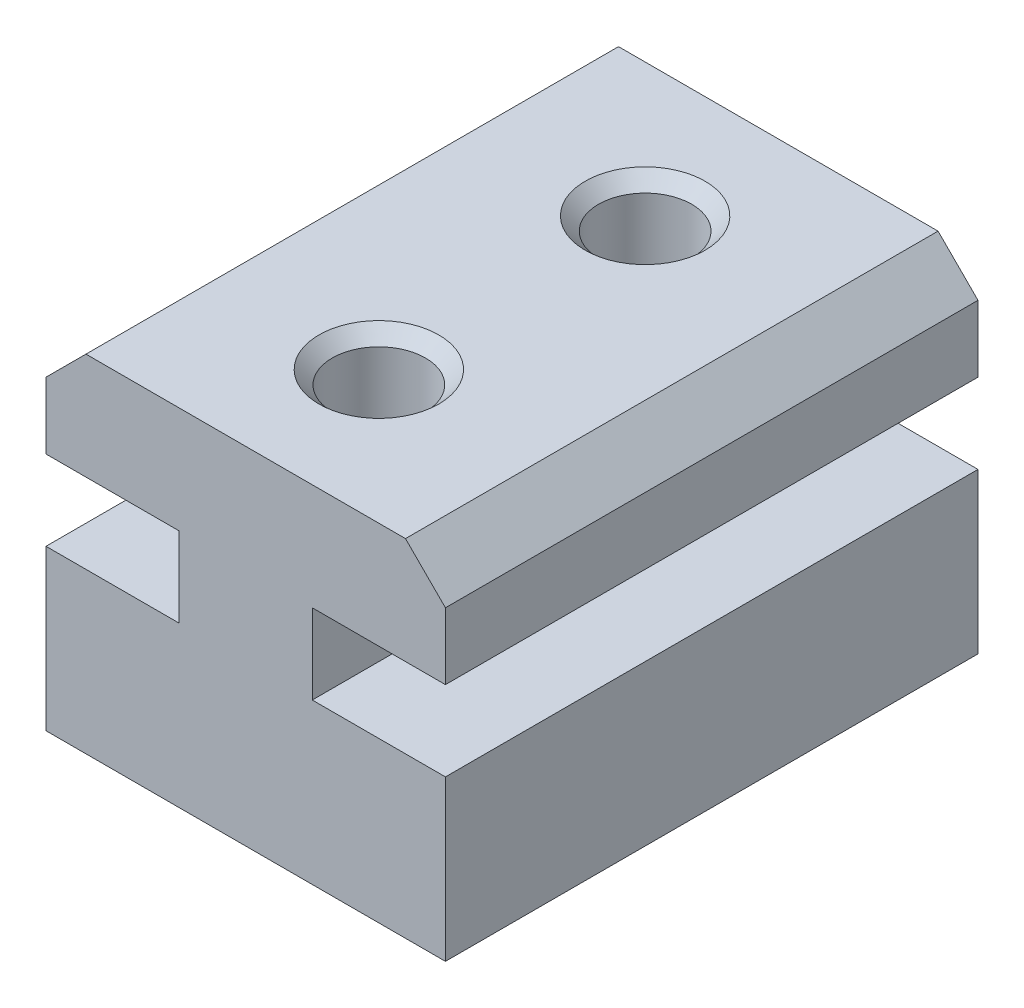
ISO-10303-21;
HEADER;
FILE_DESCRIPTION(('STEP AP214'),'2;1');
FILE_NAME('part.step','',(''),(''),'','','');
FILE_SCHEMA(('AUTOMOTIVE_DESIGN { 1 0 10303 214 1 1 1 1 }'));
ENDSEC;
DATA;
#1=APPLICATION_CONTEXT('core data for automotive mechanical design processes');
#2=APPLICATION_PROTOCOL_DEFINITION('international standard','automotive_design',2000,#1);
#3=PRODUCT_CONTEXT('',#1,'mechanical');
#4=PRODUCT('Part','Part','',(#3));
#5=PRODUCT_RELATED_PRODUCT_CATEGORY('part','',(#4));
#6=PRODUCT_DEFINITION_FORMATION('','',#4);
#7=PRODUCT_DEFINITION_CONTEXT('part definition',#1,'design');
#8=PRODUCT_DEFINITION('design','',#6,#7);
#9=PRODUCT_DEFINITION_SHAPE('','',#8);
#10=(LENGTH_UNIT() NAMED_UNIT(*) SI_UNIT(.MILLI.,.METRE.));
#11=(NAMED_UNIT(*) PLANE_ANGLE_UNIT() SI_UNIT($,.RADIAN.));
#12=(NAMED_UNIT(*) SI_UNIT($,.STERADIAN.) SOLID_ANGLE_UNIT());
#13=UNCERTAINTY_MEASURE_WITH_UNIT(LENGTH_MEASURE(1.E-05),#10,'distance_accuracy_value','');
#14=(GEOMETRIC_REPRESENTATION_CONTEXT(3) GLOBAL_UNCERTAINTY_ASSIGNED_CONTEXT((#13)) GLOBAL_UNIT_ASSIGNED_CONTEXT((#10,
#11,#12)) REPRESENTATION_CONTEXT('',''));
#15=CARTESIAN_POINT('',(0.,0.,0.));
#16=DIRECTION('',(0.,0.,1.));
#17=DIRECTION('',(1.,0.,0.));
#18=AXIS2_PLACEMENT_3D('',#15,#16,#17);
#19=CARTESIAN_POINT('',(0.,6.,10.));
#20=DIRECTION('',(1.,0.,0.));
#21=DIRECTION('',(0.,0.,-1.));
#22=AXIS2_PLACEMENT_3D('',#19,#20,#21);
#23=PLANE('',#22);
#24=DIRECTION('',(0.,-1.,0.));
#25=VECTOR('',#24,1.);
#26=CARTESIAN_POINT('',(0.,6.,-10.));
#27=LINE('',#26,#25);
#28=CARTESIAN_POINT('',(0.,6.,-10.));
#29=VERTEX_POINT('',#28);
#30=CARTESIAN_POINT('',(0.,0.,-10.));
#31=VERTEX_POINT('',#30);
#32=EDGE_CURVE('E177',#29,#31,#27,.T.);
#33=ORIENTED_EDGE('',*,*,#32,.T.);
#34=DIRECTION('',(0.,0.,-1.));
#35=VECTOR('',#34,1.);
#36=CARTESIAN_POINT('',(0.,0.,10.));
#37=LINE('',#36,#35);
#38=CARTESIAN_POINT('',(0.,0.,10.));
#39=VERTEX_POINT('',#38);
#40=EDGE_CURVE('E156',#39,#31,#37,.T.);
#41=ORIENTED_EDGE('',*,*,#40,.F.);
#42=DIRECTION('',(0.,-1.,0.));
#43=VECTOR('',#42,1.);
#44=CARTESIAN_POINT('',(0.,6.,10.));
#45=LINE('',#44,#43);
#46=CARTESIAN_POINT('',(0.,6.,10.));
#47=VERTEX_POINT('',#46);
#48=EDGE_CURVE('E164',#47,#39,#45,.T.);
#49=ORIENTED_EDGE('',*,*,#48,.F.);
#50=DIRECTION('',(0.,0.,-1.));
#51=VECTOR('',#50,1.);
#52=CARTESIAN_POINT('',(0.,6.,10.));
#53=LINE('',#52,#51);
#54=EDGE_CURVE('E274',#47,#29,#53,.T.);
#55=ORIENTED_EDGE('',*,*,#54,.T.);
#56=EDGE_LOOP('',(#33,#41,#49,#55));
#57=FACE_BOUND('',#56,.T.);
#58=ADVANCED_FACE('F45',(#57),#23,.F.);
#59=CARTESIAN_POINT('',(0.,0.,10.));
#60=DIRECTION('',(0.,1.,0.));
#61=DIRECTION('',(0.,0.,1.));
#62=AXIS2_PLACEMENT_3D('',#59,#60,#61);
#63=PLANE('',#62);
#64=CARTESIAN_POINT('',(7.5,0.,5.));
#65=DIRECTION('',(0.,1.,0.));
#66=DIRECTION('',(-1.,0.,0.));
#67=AXIS2_PLACEMENT_3D('',#64,#65,#66);
#68=CIRCLE('',#67,1.75);
#69=CARTESIAN_POINT('',(5.75,0.,5.));
#70=VERTEX_POINT('',#69);
#71=EDGE_CURVE('E240',#70,#70,#68,.T.);
#72=ORIENTED_EDGE('',*,*,#71,.T.);
#73=EDGE_LOOP('',(#72));
#74=FACE_BOUND('',#73,.T.);
#75=CARTESIAN_POINT('',(7.5,0.,-5.));
#76=DIRECTION('',(0.,1.,0.));
#77=DIRECTION('',(-1.,0.,0.));
#78=AXIS2_PLACEMENT_3D('',#75,#76,#77);
#79=CIRCLE('',#78,1.75);
#80=CARTESIAN_POINT('',(5.75,0.,-5.));
#81=VERTEX_POINT('',#80);
#82=EDGE_CURVE('E237',#81,#81,#79,.T.);
#83=ORIENTED_EDGE('',*,*,#82,.T.);
#84=EDGE_LOOP('',(#83));
#85=FACE_BOUND('',#84,.T.);
#86=DIRECTION('',(1.,0.,0.));
#87=VECTOR('',#86,1.);
#88=CARTESIAN_POINT('',(0.,0.,-10.));
#89=LINE('',#88,#87);
#90=CARTESIAN_POINT('',(15.,0.,-10.));
#91=VERTEX_POINT('',#90);
#92=EDGE_CURVE('E277',#31,#91,#89,.T.);
#93=ORIENTED_EDGE('',*,*,#92,.T.);
#94=DIRECTION('',(0.,0.,-1.));
#95=VECTOR('',#94,1.);
#96=CARTESIAN_POINT('',(15.,0.,10.));
#97=LINE('',#96,#95);
#98=CARTESIAN_POINT('',(15.,0.,10.));
#99=VERTEX_POINT('',#98);
#100=EDGE_CURVE('E159',#99,#91,#97,.T.);
#101=ORIENTED_EDGE('',*,*,#100,.F.);
#102=DIRECTION('',(1.,0.,0.));
#103=VECTOR('',#102,1.);
#104=CARTESIAN_POINT('',(0.,0.,10.));
#105=LINE('',#104,#103);
#106=EDGE_CURVE('E152',#39,#99,#105,.T.);
#107=ORIENTED_EDGE('',*,*,#106,.F.);
#108=ORIENTED_EDGE('',*,*,#40,.T.);
#109=EDGE_LOOP('',(#93,#101,#107,#108));
#110=FACE_BOUND('',#109,.T.);
#111=ADVANCED_FACE('F154',(#74,#85,#110),#63,.F.);
#112=CARTESIAN_POINT('',(15.,0.,10.));
#113=DIRECTION('',(-1.,0.,0.));
#114=DIRECTION('',(0.,0.,1.));
#115=AXIS2_PLACEMENT_3D('',#112,#113,#114);
#116=PLANE('',#115);
#117=DIRECTION('',(0.,1.,0.));
#118=VECTOR('',#117,1.);
#119=CARTESIAN_POINT('',(15.,0.,-10.));
#120=LINE('',#119,#118);
#121=CARTESIAN_POINT('',(15.,6.,-10.));
#122=VERTEX_POINT('',#121);
#123=EDGE_CURVE('E280',#91,#122,#120,.T.);
#124=ORIENTED_EDGE('',*,*,#123,.T.);
#125=DIRECTION('',(0.,0.,-1.));
#126=VECTOR('',#125,1.);
#127=CARTESIAN_POINT('',(15.,6.,10.));
#128=LINE('',#127,#126);
#129=CARTESIAN_POINT('',(15.,6.,10.));
#130=VERTEX_POINT('',#129);
#131=EDGE_CURVE('E186',#130,#122,#128,.T.);
#132=ORIENTED_EDGE('',*,*,#131,.F.);
#133=DIRECTION('',(0.,1.,0.));
#134=VECTOR('',#133,1.);
#135=CARTESIAN_POINT('',(15.,0.,10.));
#136=LINE('',#135,#134);
#137=EDGE_CURVE('E163',#99,#130,#136,.T.);
#138=ORIENTED_EDGE('',*,*,#137,.F.);
#139=ORIENTED_EDGE('',*,*,#100,.T.);
#140=EDGE_LOOP('',(#124,#132,#138,#139));
#141=FACE_BOUND('',#140,.T.);
#142=ADVANCED_FACE('F358',(#141),#116,.F.);
#143=CARTESIAN_POINT('',(15.,6.,10.));
#144=DIRECTION('',(0.,-1.,0.));
#145=DIRECTION('',(1.,0.,0.));
#146=AXIS2_PLACEMENT_3D('',#143,#144,#145);
#147=PLANE('',#146);
#148=DIRECTION('',(-1.,0.,0.));
#149=VECTOR('',#148,1.);
#150=CARTESIAN_POINT('',(15.,6.,-10.));
#151=LINE('',#150,#149);
#152=CARTESIAN_POINT('',(10.,6.,-10.));
#153=VERTEX_POINT('',#152);
#154=EDGE_CURVE('E283',#122,#153,#151,.T.);
#155=ORIENTED_EDGE('',*,*,#154,.T.);
#156=DIRECTION('',(0.,0.,-1.));
#157=VECTOR('',#156,1.);
#158=CARTESIAN_POINT('',(10.,6.,10.));
#159=LINE('',#158,#157);
#160=CARTESIAN_POINT('',(10.,6.,10.));
#161=VERTEX_POINT('',#160);
#162=EDGE_CURVE('E331',#161,#153,#159,.T.);
#163=ORIENTED_EDGE('',*,*,#162,.F.);
#164=DIRECTION('',(-1.,0.,0.));
#165=VECTOR('',#164,1.);
#166=CARTESIAN_POINT('',(15.,6.,10.));
#167=LINE('',#166,#165);
#168=EDGE_CURVE('E248',#130,#161,#167,.T.);
#169=ORIENTED_EDGE('',*,*,#168,.F.);
#170=ORIENTED_EDGE('',*,*,#131,.T.);
#171=EDGE_LOOP('',(#155,#163,#169,#170));
#172=FACE_BOUND('',#171,.T.);
#173=ADVANCED_FACE('F340',(#172),#147,.F.);
#174=CARTESIAN_POINT('',(10.,6.,10.));
#175=DIRECTION('',(-1.,0.,0.));
#176=DIRECTION('',(0.,0.,1.));
#177=AXIS2_PLACEMENT_3D('',#174,#175,#176);
#178=PLANE('',#177);
#179=DIRECTION('',(0.,1.,0.));
#180=VECTOR('',#179,1.);
#181=CARTESIAN_POINT('',(10.,6.,-10.));
#182=LINE('',#181,#180);
#183=CARTESIAN_POINT('',(10.,9.,-10.));
#184=VERTEX_POINT('',#183);
#185=EDGE_CURVE('E286',#153,#184,#182,.T.);
#186=ORIENTED_EDGE('',*,*,#185,.T.);
#187=DIRECTION('',(0.,0.,-1.));
#188=VECTOR('',#187,1.);
#189=CARTESIAN_POINT('',(10.,9.,10.));
#190=LINE('',#189,#188);
#191=CARTESIAN_POINT('',(10.,9.,10.));
#192=VERTEX_POINT('',#191);
#193=EDGE_CURVE('E327',#192,#184,#190,.T.);
#194=ORIENTED_EDGE('',*,*,#193,.F.);
#195=DIRECTION('',(0.,1.,0.));
#196=VECTOR('',#195,1.);
#197=CARTESIAN_POINT('',(10.,6.,10.));
#198=LINE('',#197,#196);
#199=EDGE_CURVE('E251',#161,#192,#198,.T.);
#200=ORIENTED_EDGE('',*,*,#199,.F.);
#201=ORIENTED_EDGE('',*,*,#162,.T.);
#202=EDGE_LOOP('',(#186,#194,#200,#201));
#203=FACE_BOUND('',#202,.T.);
#204=ADVANCED_FACE('F351',(#203),#178,.F.);
#205=CARTESIAN_POINT('',(10.,9.,10.));
#206=DIRECTION('',(0.,1.,0.));
#207=DIRECTION('',(0.,0.,1.));
#208=AXIS2_PLACEMENT_3D('',#205,#206,#207);
#209=PLANE('',#208);
#210=DIRECTION('',(1.,0.,0.));
#211=VECTOR('',#210,1.);
#212=CARTESIAN_POINT('',(10.,9.,-10.));
#213=LINE('',#212,#211);
#214=CARTESIAN_POINT('',(15.,9.,-10.));
#215=VERTEX_POINT('',#214);
#216=EDGE_CURVE('E289',#184,#215,#213,.T.);
#217=ORIENTED_EDGE('',*,*,#216,.T.);
#218=DIRECTION('',(0.,0.,-1.));
#219=VECTOR('',#218,1.);
#220=CARTESIAN_POINT('',(15.,9.,10.));
#221=LINE('',#220,#219);
#222=CARTESIAN_POINT('',(15.,9.,10.));
#223=VERTEX_POINT('',#222);
#224=EDGE_CURVE('E323',#223,#215,#221,.T.);
#225=ORIENTED_EDGE('',*,*,#224,.F.);
#226=DIRECTION('',(1.,0.,0.));
#227=VECTOR('',#226,1.);
#228=CARTESIAN_POINT('',(10.,9.,10.));
#229=LINE('',#228,#227);
#230=EDGE_CURVE('E254',#192,#223,#229,.T.);
#231=ORIENTED_EDGE('',*,*,#230,.F.);
#232=ORIENTED_EDGE('',*,*,#193,.T.);
#233=EDGE_LOOP('',(#217,#225,#231,#232));
#234=FACE_BOUND('',#233,.T.);
#235=ADVANCED_FACE('F355',(#234),#209,.F.);
#236=CARTESIAN_POINT('',(15.,9.,10.));
#237=DIRECTION('',(-1.,0.,0.));
#238=DIRECTION('',(0.,0.,1.));
#239=AXIS2_PLACEMENT_3D('',#236,#237,#238);
#240=PLANE('',#239);
#241=DIRECTION('',(0.,1.,0.));
#242=VECTOR('',#241,1.);
#243=CARTESIAN_POINT('',(15.,9.,-10.));
#244=LINE('',#243,#242);
#245=CARTESIAN_POINT('',(15.,11.5,-10.));
#246=VERTEX_POINT('',#245);
#247=EDGE_CURVE('E292',#215,#246,#244,.T.);
#248=ORIENTED_EDGE('',*,*,#247,.T.);
#249=DIRECTION('',(0.,0.,1.));
#250=VECTOR('',#249,1.);
#251=CARTESIAN_POINT('',(15.,11.5,10.));
#252=LINE('',#251,#250);
#253=CARTESIAN_POINT('',(15.,11.5,10.));
#254=VERTEX_POINT('',#253);
#255=EDGE_CURVE('E62',#246,#254,#252,.T.);
#256=ORIENTED_EDGE('',*,*,#255,.T.);
#257=DIRECTION('',(0.,1.,0.));
#258=VECTOR('',#257,1.);
#259=CARTESIAN_POINT('',(15.,9.,10.));
#260=LINE('',#259,#258);
#261=EDGE_CURVE('E257',#223,#254,#260,.T.);
#262=ORIENTED_EDGE('',*,*,#261,.F.);
#263=ORIENTED_EDGE('',*,*,#224,.T.);
#264=EDGE_LOOP('',(#248,#256,#262,#263));
#265=FACE_BOUND('',#264,.T.);
#266=ADVANCED_FACE('F429',(#265),#240,.F.);
#267=CARTESIAN_POINT('',(15.,13.,10.));
#268=DIRECTION('',(0.,-1.,0.));
#269=DIRECTION('',(1.,0.,0.));
#270=AXIS2_PLACEMENT_3D('',#267,#268,#269);
#271=PLANE('',#270);
#272=CARTESIAN_POINT('',(7.5,13.,-5.));
#273=DIRECTION('',(0.,-1.,0.));
#274=DIRECTION('',(1.,0.,0.));
#275=AXIS2_PLACEMENT_3D('',#272,#273,#274);
#276=CIRCLE('',#275,2.25);
#277=CARTESIAN_POINT('',(9.75000000000001,13.,-5.));
#278=VERTEX_POINT('',#277);
#279=EDGE_CURVE('E55',#278,#278,#276,.T.);
#280=ORIENTED_EDGE('',*,*,#279,.T.);
#281=EDGE_LOOP('',(#280));
#282=FACE_BOUND('',#281,.T.);
#283=CARTESIAN_POINT('',(7.5,13.,5.));
#284=DIRECTION('',(0.,-1.,0.));
#285=DIRECTION('',(1.,0.,0.));
#286=AXIS2_PLACEMENT_3D('',#283,#284,#285);
#287=CIRCLE('',#286,2.25);
#288=CARTESIAN_POINT('',(9.75000000000001,13.,5.));
#289=VERTEX_POINT('',#288);
#290=EDGE_CURVE('E213',#289,#289,#287,.T.);
#291=ORIENTED_EDGE('',*,*,#290,.T.);
#292=EDGE_LOOP('',(#291));
#293=FACE_BOUND('',#292,.T.);
#294=DIRECTION('',(-1.,0.,0.));
#295=VECTOR('',#294,1.);
#296=CARTESIAN_POINT('',(15.,13.,-10.));
#297=LINE('',#296,#295);
#298=CARTESIAN_POINT('',(13.5,13.,-10.));
#299=VERTEX_POINT('',#298);
#300=CARTESIAN_POINT('',(1.50000000000001,13.,-10.));
#301=VERTEX_POINT('',#300);
#302=EDGE_CURVE('E295',#299,#301,#297,.T.);
#303=ORIENTED_EDGE('',*,*,#302,.T.);
#304=DIRECTION('',(0.,0.,1.));
#305=VECTOR('',#304,1.);
#306=CARTESIAN_POINT('',(1.50000000000001,13.,10.));
#307=LINE('',#306,#305);
#308=CARTESIAN_POINT('',(1.50000000000001,13.,10.));
#309=VERTEX_POINT('',#308);
#310=EDGE_CURVE('E70',#301,#309,#307,.T.);
#311=ORIENTED_EDGE('',*,*,#310,.T.);
#312=DIRECTION('',(-1.,0.,0.));
#313=VECTOR('',#312,1.);
#314=CARTESIAN_POINT('',(15.,13.,10.));
#315=LINE('',#314,#313);
#316=CARTESIAN_POINT('',(13.5,13.,10.));
#317=VERTEX_POINT('',#316);
#318=EDGE_CURVE('E260',#317,#309,#315,.T.);
#319=ORIENTED_EDGE('',*,*,#318,.F.);
#320=DIRECTION('',(0.,0.,-1.));
#321=VECTOR('',#320,1.);
#322=CARTESIAN_POINT('',(13.5,13.,10.));
#323=LINE('',#322,#321);
#324=EDGE_CURVE('E195',#317,#299,#323,.T.);
#325=ORIENTED_EDGE('',*,*,#324,.T.);
#326=EDGE_LOOP('',(#303,#311,#319,#325));
#327=FACE_BOUND('',#326,.T.);
#328=ADVANCED_FACE('F220',(#282,#293,#327),#271,.F.);
#329=CARTESIAN_POINT('',(0.,13.,10.));
#330=DIRECTION('',(1.,0.,0.));
#331=DIRECTION('',(0.,1.,0.));
#332=AXIS2_PLACEMENT_3D('',#329,#330,#331);
#333=PLANE('',#332);
#334=DIRECTION('',(0.,-1.,0.));
#335=VECTOR('',#334,1.);
#336=CARTESIAN_POINT('',(0.,13.,10.));
#337=LINE('',#336,#335);
#338=CARTESIAN_POINT('',(0.,11.5,10.));
#339=VERTEX_POINT('',#338);
#340=CARTESIAN_POINT('',(0.,9.00000000000001,10.));
#341=VERTEX_POINT('',#340);
#342=EDGE_CURVE('E263',#339,#341,#337,.T.);
#343=ORIENTED_EDGE('',*,*,#342,.F.);
#344=DIRECTION('',(0.,0.,-1.));
#345=VECTOR('',#344,1.);
#346=CARTESIAN_POINT('',(0.,11.5,10.));
#347=LINE('',#346,#345);
#348=CARTESIAN_POINT('',(0.,11.5,-10.));
#349=VERTEX_POINT('',#348);
#350=EDGE_CURVE('E179',#339,#349,#347,.T.);
#351=ORIENTED_EDGE('',*,*,#350,.T.);
#352=DIRECTION('',(0.,-1.,0.));
#353=VECTOR('',#352,1.);
#354=CARTESIAN_POINT('',(0.,13.,-10.));
#355=LINE('',#354,#353);
#356=CARTESIAN_POINT('',(0.,9.00000000000001,-10.));
#357=VERTEX_POINT('',#356);
#358=EDGE_CURVE('E298',#349,#357,#355,.T.);
#359=ORIENTED_EDGE('',*,*,#358,.T.);
#360=DIRECTION('',(0.,0.,-1.));
#361=VECTOR('',#360,1.);
#362=CARTESIAN_POINT('',(0.,9.00000000000001,10.));
#363=LINE('',#362,#361);
#364=EDGE_CURVE('E319',#341,#357,#363,.T.);
#365=ORIENTED_EDGE('',*,*,#364,.F.);
#366=EDGE_LOOP('',(#343,#351,#359,#365));
#367=FACE_BOUND('',#366,.T.);
#368=ADVANCED_FACE('F399',(#367),#333,.F.);
#369=CARTESIAN_POINT('',(0.,9.00000000000001,10.));
#370=DIRECTION('',(0.,1.,0.));
#371=DIRECTION('',(-1.,0.,0.));
#372=AXIS2_PLACEMENT_3D('',#369,#370,#371);
#373=PLANE('',#372);
#374=DIRECTION('',(1.,0.,0.));
#375=VECTOR('',#374,1.);
#376=CARTESIAN_POINT('',(0.,9.00000000000001,-10.));
#377=LINE('',#376,#375);
#378=CARTESIAN_POINT('',(5.,9.,-10.));
#379=VERTEX_POINT('',#378);
#380=EDGE_CURVE('E301',#357,#379,#377,.T.);
#381=ORIENTED_EDGE('',*,*,#380,.T.);
#382=DIRECTION('',(0.,0.,-1.));
#383=VECTOR('',#382,1.);
#384=CARTESIAN_POINT('',(5.,9.,10.));
#385=LINE('',#384,#383);
#386=CARTESIAN_POINT('',(5.,9.,10.));
#387=VERTEX_POINT('',#386);
#388=EDGE_CURVE('E315',#387,#379,#385,.T.);
#389=ORIENTED_EDGE('',*,*,#388,.F.);
#390=DIRECTION('',(1.,0.,0.));
#391=VECTOR('',#390,1.);
#392=CARTESIAN_POINT('',(0.,9.00000000000001,10.));
#393=LINE('',#392,#391);
#394=EDGE_CURVE('E266',#341,#387,#393,.T.);
#395=ORIENTED_EDGE('',*,*,#394,.F.);
#396=ORIENTED_EDGE('',*,*,#364,.T.);
#397=EDGE_LOOP('',(#381,#389,#395,#396));
#398=FACE_BOUND('',#397,.T.);
#399=ADVANCED_FACE('F406',(#398),#373,.F.);
#400=CARTESIAN_POINT('',(5.,9.,10.));
#401=DIRECTION('',(1.,0.,0.));
#402=DIRECTION('',(0.,1.,0.));
#403=AXIS2_PLACEMENT_3D('',#400,#401,#402);
#404=PLANE('',#403);
#405=DIRECTION('',(0.,-1.,0.));
#406=VECTOR('',#405,1.);
#407=CARTESIAN_POINT('',(5.,9.,-10.));
#408=LINE('',#407,#406);
#409=CARTESIAN_POINT('',(5.,6.,-10.));
#410=VERTEX_POINT('',#409);
#411=EDGE_CURVE('E304',#379,#410,#408,.T.);
#412=ORIENTED_EDGE('',*,*,#411,.T.);
#413=DIRECTION('',(0.,0.,-1.));
#414=VECTOR('',#413,1.);
#415=CARTESIAN_POINT('',(5.,6.,10.));
#416=LINE('',#415,#414);
#417=CARTESIAN_POINT('',(5.,6.,10.));
#418=VERTEX_POINT('',#417);
#419=EDGE_CURVE('E311',#418,#410,#416,.T.);
#420=ORIENTED_EDGE('',*,*,#419,.F.);
#421=DIRECTION('',(0.,-1.,0.));
#422=VECTOR('',#421,1.);
#423=CARTESIAN_POINT('',(5.,9.,10.));
#424=LINE('',#423,#422);
#425=EDGE_CURVE('E269',#387,#418,#424,.T.);
#426=ORIENTED_EDGE('',*,*,#425,.F.);
#427=ORIENTED_EDGE('',*,*,#388,.T.);
#428=EDGE_LOOP('',(#412,#420,#426,#427));
#429=FACE_BOUND('',#428,.T.);
#430=ADVANCED_FACE('F409',(#429),#404,.F.);
#431=CARTESIAN_POINT('',(5.,6.,10.));
#432=DIRECTION('',(0.,-1.,0.));
#433=DIRECTION('',(0.,0.,-1.));
#434=AXIS2_PLACEMENT_3D('',#431,#432,#433);
#435=PLANE('',#434);
#436=DIRECTION('',(-1.,0.,0.));
#437=VECTOR('',#436,1.);
#438=CARTESIAN_POINT('',(5.,6.,-10.));
#439=LINE('',#438,#437);
#440=EDGE_CURVE('E174',#410,#29,#439,.T.);
#441=ORIENTED_EDGE('',*,*,#440,.T.);
#442=ORIENTED_EDGE('',*,*,#54,.F.);
#443=DIRECTION('',(-1.,0.,0.));
#444=VECTOR('',#443,1.);
#445=CARTESIAN_POINT('',(5.,6.,10.));
#446=LINE('',#445,#444);
#447=EDGE_CURVE('E169',#418,#47,#446,.T.);
#448=ORIENTED_EDGE('',*,*,#447,.F.);
#449=ORIENTED_EDGE('',*,*,#419,.T.);
#450=EDGE_LOOP('',(#441,#442,#448,#449));
#451=FACE_BOUND('',#450,.T.);
#452=ADVANCED_FACE('F412',(#451),#435,.F.);
#453=CARTESIAN_POINT('',(0.,0.,10.));
#454=DIRECTION('',(0.,0.,1.));
#455=DIRECTION('',(1.,0.,0.));
#456=AXIS2_PLACEMENT_3D('',#453,#454,#455);
#457=PLANE('',#456);
#458=ORIENTED_EDGE('',*,*,#318,.T.);
#459=DIRECTION('',(0.707106781186548,0.707106781186547,0.));
#460=VECTOR('',#459,1.);
#461=CARTESIAN_POINT('',(-5.75,5.75000000000001,10.));
#462=LINE('',#461,#460);
#463=EDGE_CURVE('E204',#309,#339,#462,.F.);
#464=ORIENTED_EDGE('',*,*,#463,.T.);
#465=ORIENTED_EDGE('',*,*,#342,.T.);
#466=ORIENTED_EDGE('',*,*,#394,.T.);
#467=ORIENTED_EDGE('',*,*,#425,.T.);
#468=ORIENTED_EDGE('',*,*,#447,.T.);
#469=ORIENTED_EDGE('',*,*,#48,.T.);
#470=ORIENTED_EDGE('',*,*,#106,.T.);
#471=ORIENTED_EDGE('',*,*,#137,.T.);
#472=ORIENTED_EDGE('',*,*,#168,.T.);
#473=ORIENTED_EDGE('',*,*,#199,.T.);
#474=ORIENTED_EDGE('',*,*,#230,.T.);
#475=ORIENTED_EDGE('',*,*,#261,.T.);
#476=DIRECTION('',(0.707106781186547,-0.707106781186548,0.));
#477=VECTOR('',#476,1.);
#478=CARTESIAN_POINT('',(13.25,13.25,10.));
#479=LINE('',#478,#477);
#480=EDGE_CURVE('E201',#254,#317,#479,.F.);
#481=ORIENTED_EDGE('',*,*,#480,.T.);
#482=EDGE_LOOP('',(#458,#464,#465,#466,#467,#468,#469,#470,#471,#472,#473,#474,#475,#481));
#483=FACE_BOUND('',#482,.T.);
#484=ADVANCED_FACE('F167',(#483),#457,.T.);
#485=CARTESIAN_POINT('',(0.,0.,-10.));
#486=DIRECTION('',(0.,0.,1.));
#487=DIRECTION('',(1.,0.,0.));
#488=AXIS2_PLACEMENT_3D('',#485,#486,#487);
#489=PLANE('',#488);
#490=ORIENTED_EDGE('',*,*,#358,.F.);
#491=DIRECTION('',(-0.707106781186548,-0.707106781186547,0.));
#492=VECTOR('',#491,1.);
#493=CARTESIAN_POINT('',(0.,11.5,-10.));
#494=LINE('',#493,#492);
#495=EDGE_CURVE('E192',#349,#301,#494,.F.);
#496=ORIENTED_EDGE('',*,*,#495,.T.);
#497=ORIENTED_EDGE('',*,*,#302,.F.);
#498=DIRECTION('',(-0.707106781186547,0.707106781186548,0.));
#499=VECTOR('',#498,1.);
#500=CARTESIAN_POINT('',(13.5,13.,-10.));
#501=LINE('',#500,#499);
#502=EDGE_CURVE('E184',#299,#246,#501,.F.);
#503=ORIENTED_EDGE('',*,*,#502,.T.);
#504=ORIENTED_EDGE('',*,*,#247,.F.);
#505=ORIENTED_EDGE('',*,*,#216,.F.);
#506=ORIENTED_EDGE('',*,*,#185,.F.);
#507=ORIENTED_EDGE('',*,*,#154,.F.);
#508=ORIENTED_EDGE('',*,*,#123,.F.);
#509=ORIENTED_EDGE('',*,*,#92,.F.);
#510=ORIENTED_EDGE('',*,*,#32,.F.);
#511=ORIENTED_EDGE('',*,*,#440,.F.);
#512=ORIENTED_EDGE('',*,*,#411,.F.);
#513=ORIENTED_EDGE('',*,*,#380,.F.);
#514=EDGE_LOOP('',(#490,#496,#497,#503,#504,#505,#506,#507,#508,#509,#510,#511,#512,#513));
#515=FACE_BOUND('',#514,.T.);
#516=ADVANCED_FACE('F233',(#515),#489,.F.);
#517=CARTESIAN_POINT('',(7.5,0.,-5.));
#518=DIRECTION('',(0.,1.,0.));
#519=DIRECTION('',(-1.,0.,0.));
#520=AXIS2_PLACEMENT_3D('',#517,#518,#519);
#521=CYLINDRICAL_SURFACE('',#520,1.75);
#522=CARTESIAN_POINT('',(7.5,12.5,-5.));
#523=DIRECTION('',(0.,-1.,0.));
#524=DIRECTION('',(0.,0.,-1.));
#525=AXIS2_PLACEMENT_3D('',#522,#523,#524);
#526=CIRCLE('',#525,1.75);
#527=CARTESIAN_POINT('',(7.5,12.5,-6.75));
#528=VERTEX_POINT('',#527);
#529=EDGE_CURVE('E209',#528,#528,#526,.F.);
#530=ORIENTED_EDGE('',*,*,#529,.T.);
#531=EDGE_LOOP('',(#530));
#532=FACE_BOUND('',#531,.T.);
#533=ORIENTED_EDGE('',*,*,#82,.F.);
#534=EDGE_LOOP('',(#533));
#535=FACE_BOUND('',#534,.T.);
#536=ADVANCED_FACE('F229',(#532,#535),#521,.F.);
#537=CARTESIAN_POINT('',(7.5,0.,5.));
#538=DIRECTION('',(0.,1.,0.));
#539=DIRECTION('',(-1.,0.,0.));
#540=AXIS2_PLACEMENT_3D('',#537,#538,#539);
#541=CYLINDRICAL_SURFACE('',#540,1.75);
#542=CARTESIAN_POINT('',(7.5,12.5,5.));
#543=DIRECTION('',(0.,-1.,0.));
#544=DIRECTION('',(0.,0.,-1.));
#545=AXIS2_PLACEMENT_3D('',#542,#543,#544);
#546=CIRCLE('',#545,1.75);
#547=CARTESIAN_POINT('',(7.5,12.5,3.25));
#548=VERTEX_POINT('',#547);
#549=EDGE_CURVE('E11',#548,#548,#546,.F.);
#550=ORIENTED_EDGE('',*,*,#549,.T.);
#551=EDGE_LOOP('',(#550));
#552=FACE_BOUND('',#551,.T.);
#553=ORIENTED_EDGE('',*,*,#71,.F.);
#554=EDGE_LOOP('',(#553));
#555=FACE_BOUND('',#554,.T.);
#556=ADVANCED_FACE('F232',(#552,#555),#541,.F.);
#557=CARTESIAN_POINT('',(0.,11.5,10.));
#558=DIRECTION('',(0.707106781186547,-0.707106781186548,0.));
#559=DIRECTION('',(0.,0.,-1.));
#560=AXIS2_PLACEMENT_3D('',#557,#558,#559);
#561=PLANE('',#560);
#562=ORIENTED_EDGE('',*,*,#463,.F.);
#563=ORIENTED_EDGE('',*,*,#310,.F.);
#564=ORIENTED_EDGE('',*,*,#495,.F.);
#565=ORIENTED_EDGE('',*,*,#350,.F.);
#566=EDGE_LOOP('',(#562,#563,#564,#565));
#567=FACE_BOUND('',#566,.T.);
#568=ADVANCED_FACE('F374',(#567),#561,.F.);
#569=CARTESIAN_POINT('',(13.5,13.,10.));
#570=DIRECTION('',(-0.707106781186548,-0.707106781186547,0.));
#571=DIRECTION('',(0.,0.,-1.));
#572=AXIS2_PLACEMENT_3D('',#569,#570,#571);
#573=PLANE('',#572);
#574=ORIENTED_EDGE('',*,*,#480,.F.);
#575=ORIENTED_EDGE('',*,*,#255,.F.);
#576=ORIENTED_EDGE('',*,*,#502,.F.);
#577=ORIENTED_EDGE('',*,*,#324,.F.);
#578=EDGE_LOOP('',(#574,#575,#576,#577));
#579=FACE_BOUND('',#578,.T.);
#580=ADVANCED_FACE('F226',(#579),#573,.F.);
#581=CARTESIAN_POINT('',(7.5,12.5,-5.));
#582=DIRECTION('',(0.,1.,0.));
#583=DIRECTION('',(0.,0.,1.));
#584=AXIS2_PLACEMENT_3D('',#581,#582,#583);
#585=CONICAL_SURFACE('',#584,1.75,0.785398163397448);
#586=ORIENTED_EDGE('',*,*,#279,.F.);
#587=EDGE_LOOP('',(#586));
#588=FACE_BOUND('',#587,.T.);
#589=ORIENTED_EDGE('',*,*,#529,.F.);
#590=EDGE_LOOP('',(#589));
#591=FACE_BOUND('',#590,.T.);
#592=ADVANCED_FACE('F223',(#588,#591),#585,.F.);
#593=CARTESIAN_POINT('',(7.5,12.5,5.));
#594=DIRECTION('',(0.,1.,0.));
#595=DIRECTION('',(0.,0.,1.));
#596=AXIS2_PLACEMENT_3D('',#593,#594,#595);
#597=CONICAL_SURFACE('',#596,1.75,0.785398163397448);
#598=ORIENTED_EDGE('',*,*,#290,.F.);
#599=EDGE_LOOP('',(#598));
#600=FACE_BOUND('',#599,.T.);
#601=ORIENTED_EDGE('',*,*,#549,.F.);
#602=EDGE_LOOP('',(#601));
#603=FACE_BOUND('',#602,.T.);
#604=ADVANCED_FACE('F48',(#600,#603),#597,.F.);
#605=CLOSED_SHELL('',(#58,#111,#142,#173,#204,#235,#266,#328,#368,#399,#430,#452,#484,#516,#536,
#556,#568,#580,#592,#604));
#606=MANIFOLD_SOLID_BREP('B2',#605);
#607=ADVANCED_BREP_SHAPE_REPRESENTATION('',(#18,#606),#14);
#608=SHAPE_DEFINITION_REPRESENTATION(#9,#607);
ENDSEC;
END-ISO-10303-21;
